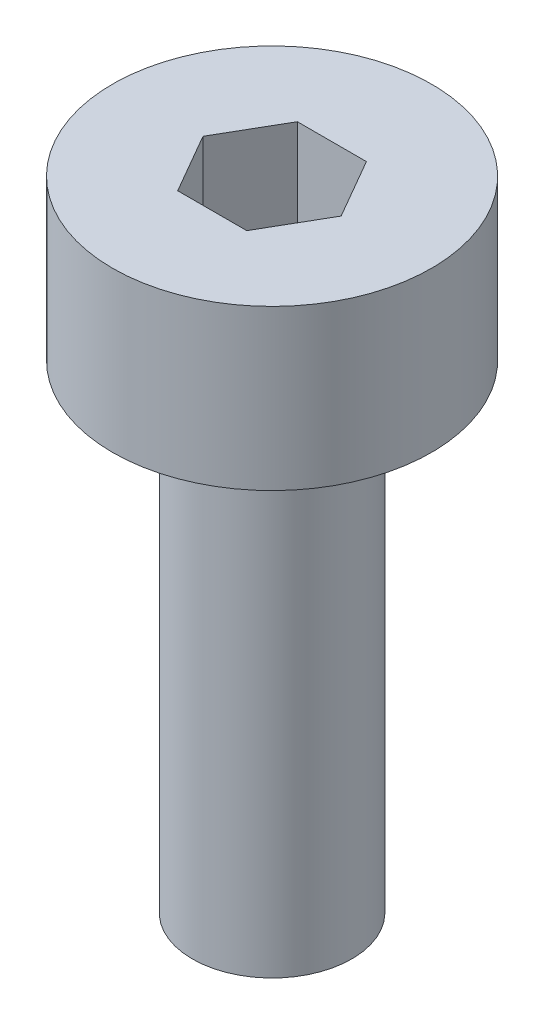
ISO-10303-21;
HEADER;
FILE_DESCRIPTION(('STEP AP214'),'2;1');
FILE_NAME('part.step','',(''),(''),'','','');
FILE_SCHEMA(('AUTOMOTIVE_DESIGN { 1 0 10303 214 1 1 1 1 }'));
ENDSEC;
DATA;
#1=APPLICATION_CONTEXT('core data for automotive mechanical design processes');
#2=APPLICATION_PROTOCOL_DEFINITION('international standard','automotive_design',2000,#1);
#3=PRODUCT_CONTEXT('',#1,'mechanical');
#4=PRODUCT('Part','Part','',(#3));
#5=PRODUCT_RELATED_PRODUCT_CATEGORY('part','',(#4));
#6=PRODUCT_DEFINITION_FORMATION('','',#4);
#7=PRODUCT_DEFINITION_CONTEXT('part definition',#1,'design');
#8=PRODUCT_DEFINITION('design','',#6,#7);
#9=PRODUCT_DEFINITION_SHAPE('','',#8);
#10=(LENGTH_UNIT() NAMED_UNIT(*) SI_UNIT(.MILLI.,.METRE.));
#11=(NAMED_UNIT(*) PLANE_ANGLE_UNIT() SI_UNIT($,.RADIAN.));
#12=(NAMED_UNIT(*) SI_UNIT($,.STERADIAN.) SOLID_ANGLE_UNIT());
#13=UNCERTAINTY_MEASURE_WITH_UNIT(LENGTH_MEASURE(1.E-05),#10,'distance_accuracy_value','');
#14=(GEOMETRIC_REPRESENTATION_CONTEXT(3) GLOBAL_UNCERTAINTY_ASSIGNED_CONTEXT((#13)) GLOBAL_UNIT_ASSIGNED_CONTEXT((#10,
#11,#12)) REPRESENTATION_CONTEXT('',''));
#15=CARTESIAN_POINT('',(0.,0.,0.));
#16=DIRECTION('',(0.,0.,1.));
#17=DIRECTION('',(1.,0.,0.));
#18=AXIS2_PLACEMENT_3D('',#15,#16,#17);
#19=CARTESIAN_POINT('',(0.,12.,0.));
#20=DIRECTION('',(0.,-1.,0.));
#21=DIRECTION('',(0.,0.,-1.));
#22=AXIS2_PLACEMENT_3D('',#19,#20,#21);
#23=CYLINDRICAL_SURFACE('',#22,2.);
#24=CARTESIAN_POINT('',(0.,12.,0.));
#25=DIRECTION('',(0.,1.,0.));
#26=DIRECTION('',(0.,0.,1.));
#27=AXIS2_PLACEMENT_3D('',#24,#25,#26);
#28=CIRCLE('',#27,2.);
#29=CARTESIAN_POINT('',(0.,12.,2.));
#30=VERTEX_POINT('',#29);
#31=EDGE_CURVE('E11',#30,#30,#28,.T.);
#32=ORIENTED_EDGE('',*,*,#31,.F.);
#33=EDGE_LOOP('',(#32));
#34=FACE_BOUND('',#33,.T.);
#35=CARTESIAN_POINT('',(0.,0.,0.));
#36=DIRECTION('',(0.,1.,0.));
#37=DIRECTION('',(0.,0.,1.));
#38=AXIS2_PLACEMENT_3D('',#35,#36,#37);
#39=CIRCLE('',#38,2.);
#40=CARTESIAN_POINT('',(0.,0.,2.));
#41=VERTEX_POINT('',#40);
#42=EDGE_CURVE('E35',#41,#41,#39,.T.);
#43=ORIENTED_EDGE('',*,*,#42,.T.);
#44=EDGE_LOOP('',(#43));
#45=FACE_BOUND('',#44,.T.);
#46=ADVANCED_FACE('F32',(#34,#45),#23,.T.);
#47=CARTESIAN_POINT('',(0.,0.,0.));
#48=DIRECTION('',(0.,1.,0.));
#49=DIRECTION('',(0.,0.,1.));
#50=AXIS2_PLACEMENT_3D('',#47,#48,#49);
#51=PLANE('',#50);
#52=ORIENTED_EDGE('',*,*,#42,.F.);
#53=EDGE_LOOP('',(#52));
#54=FACE_BOUND('',#53,.T.);
#55=ADVANCED_FACE('F163',(#54),#51,.F.);
#56=CARTESIAN_POINT('',(0.,16.,0.));
#57=DIRECTION('',(0.,-1.,0.));
#58=DIRECTION('',(0.,0.,-1.));
#59=AXIS2_PLACEMENT_3D('',#56,#57,#58);
#60=CYLINDRICAL_SURFACE('',#59,4.);
#61=CARTESIAN_POINT('',(0.,16.,0.));
#62=DIRECTION('',(0.,1.,0.));
#63=DIRECTION('',(0.,0.,1.));
#64=AXIS2_PLACEMENT_3D('',#61,#62,#63);
#65=CIRCLE('',#64,4.);
#66=CARTESIAN_POINT('',(0.,16.,4.));
#67=VERTEX_POINT('',#66);
#68=EDGE_CURVE('E139',#67,#67,#65,.T.);
#69=ORIENTED_EDGE('',*,*,#68,.F.);
#70=EDGE_LOOP('',(#69));
#71=FACE_BOUND('',#70,.T.);
#72=CARTESIAN_POINT('',(0.,12.,0.));
#73=DIRECTION('',(0.,1.,0.));
#74=DIRECTION('',(0.,0.,1.));
#75=AXIS2_PLACEMENT_3D('',#72,#73,#74);
#76=CIRCLE('',#75,4.);
#77=CARTESIAN_POINT('',(0.,12.,4.));
#78=VERTEX_POINT('',#77);
#79=EDGE_CURVE('E133',#78,#78,#76,.T.);
#80=ORIENTED_EDGE('',*,*,#79,.T.);
#81=EDGE_LOOP('',(#80));
#82=FACE_BOUND('',#81,.T.);
#83=ADVANCED_FACE('F145',(#71,#82),#60,.T.);
#84=CARTESIAN_POINT('',(0.,16.,0.));
#85=DIRECTION('',(0.,1.,0.));
#86=DIRECTION('',(0.,0.,1.));
#87=AXIS2_PLACEMENT_3D('',#84,#85,#86);
#88=PLANE('',#87);
#89=DIRECTION('',(0.5,0.,-0.866025403784439));
#90=VECTOR('',#89,1.);
#91=CARTESIAN_POINT('',(0.866025403784438,16.,1.5));
#92=LINE('',#91,#90);
#93=CARTESIAN_POINT('',(0.866025403784438,16.,1.5));
#94=VERTEX_POINT('',#93);
#95=CARTESIAN_POINT('',(1.73205080756888,16.,0.));
#96=VERTEX_POINT('',#95);
#97=EDGE_CURVE('E46',#94,#96,#92,.T.);
#98=ORIENTED_EDGE('',*,*,#97,.F.);
#99=DIRECTION('',(1.,0.,0.));
#100=VECTOR('',#99,1.);
#101=CARTESIAN_POINT('',(-0.866025403784439,16.,1.5));
#102=LINE('',#101,#100);
#103=CARTESIAN_POINT('',(-0.866025403784439,16.,1.5));
#104=VERTEX_POINT('',#103);
#105=EDGE_CURVE('E129',#104,#94,#102,.T.);
#106=ORIENTED_EDGE('',*,*,#105,.F.);
#107=DIRECTION('',(0.5,0.,0.866025403784439));
#108=VECTOR('',#107,1.);
#109=CARTESIAN_POINT('',(-1.73205080756888,16.,0.));
#110=LINE('',#109,#108);
#111=CARTESIAN_POINT('',(-1.73205080756888,16.,0.));
#112=VERTEX_POINT('',#111);
#113=EDGE_CURVE('E127',#112,#104,#110,.T.);
#114=ORIENTED_EDGE('',*,*,#113,.F.);
#115=DIRECTION('',(-0.5,0.,0.866025403784439));
#116=VECTOR('',#115,1.);
#117=CARTESIAN_POINT('',(-0.866025403784438,16.,-1.5));
#118=LINE('',#117,#116);
#119=CARTESIAN_POINT('',(-0.866025403784438,16.,-1.5));
#120=VERTEX_POINT('',#119);
#121=EDGE_CURVE('E94',#120,#112,#118,.T.);
#122=ORIENTED_EDGE('',*,*,#121,.F.);
#123=DIRECTION('',(-1.,0.,0.));
#124=VECTOR('',#123,1.);
#125=CARTESIAN_POINT('',(0.866025403784437,16.,-1.5));
#126=LINE('',#125,#124);
#127=CARTESIAN_POINT('',(0.866025403784437,16.,-1.5));
#128=VERTEX_POINT('',#127);
#129=EDGE_CURVE('E123',#128,#120,#126,.T.);
#130=ORIENTED_EDGE('',*,*,#129,.F.);
#131=DIRECTION('',(-0.5,0.,-0.866025403784439));
#132=VECTOR('',#131,1.);
#133=CARTESIAN_POINT('',(1.73205080756888,16.,0.));
#134=LINE('',#133,#132);
#135=EDGE_CURVE('E120',#96,#128,#134,.T.);
#136=ORIENTED_EDGE('',*,*,#135,.F.);
#137=EDGE_LOOP('',(#98,#106,#114,#122,#130,#136));
#138=FACE_BOUND('',#137,.T.);
#139=ORIENTED_EDGE('',*,*,#68,.T.);
#140=EDGE_LOOP('',(#139));
#141=FACE_BOUND('',#140,.T.);
#142=ADVANCED_FACE('F150',(#138,#141),#88,.T.);
#143=CARTESIAN_POINT('',(0.,12.,0.));
#144=DIRECTION('',(0.,1.,0.));
#145=DIRECTION('',(0.,0.,1.));
#146=AXIS2_PLACEMENT_3D('',#143,#144,#145);
#147=PLANE('',#146);
#148=ORIENTED_EDGE('',*,*,#31,.T.);
#149=EDGE_LOOP('',(#148));
#150=FACE_BOUND('',#149,.T.);
#151=ORIENTED_EDGE('',*,*,#79,.F.);
#152=EDGE_LOOP('',(#151));
#153=FACE_BOUND('',#152,.T.);
#154=ADVANCED_FACE('F147',(#150,#153),#147,.F.);
#155=CARTESIAN_POINT('',(0.866025403784438,13.5,1.5));
#156=DIRECTION('',(0.866025403784439,0.,0.5));
#157=DIRECTION('',(0.5,0.,-0.866025403784439));
#158=AXIS2_PLACEMENT_3D('',#155,#156,#157);
#159=PLANE('',#158);
#160=ORIENTED_EDGE('',*,*,#97,.T.);
#161=DIRECTION('',(0.,1.,0.));
#162=VECTOR('',#161,1.);
#163=CARTESIAN_POINT('',(1.73205080756888,13.5,0.));
#164=LINE('',#163,#162);
#165=CARTESIAN_POINT('',(1.73205080756888,13.5,0.));
#166=VERTEX_POINT('',#165);
#167=EDGE_CURVE('E76',#166,#96,#164,.T.);
#168=ORIENTED_EDGE('',*,*,#167,.F.);
#169=DIRECTION('',(0.5,0.,-0.866025403784439));
#170=VECTOR('',#169,1.);
#171=CARTESIAN_POINT('',(0.866025403784438,13.5,1.5));
#172=LINE('',#171,#170);
#173=CARTESIAN_POINT('',(0.866025403784438,13.5,1.5));
#174=VERTEX_POINT('',#173);
#175=EDGE_CURVE('E131',#174,#166,#172,.T.);
#176=ORIENTED_EDGE('',*,*,#175,.F.);
#177=DIRECTION('',(0.,1.,0.));
#178=VECTOR('',#177,1.);
#179=CARTESIAN_POINT('',(0.866025403784438,13.5,1.5));
#180=LINE('',#179,#178);
#181=EDGE_CURVE('E54',#174,#94,#180,.T.);
#182=ORIENTED_EDGE('',*,*,#181,.T.);
#183=EDGE_LOOP('',(#160,#168,#176,#182));
#184=FACE_BOUND('',#183,.T.);
#185=ADVANCED_FACE('F149',(#184),#159,.F.);
#186=CARTESIAN_POINT('',(-0.866025403784439,13.5,1.5));
#187=DIRECTION('',(0.,0.,1.));
#188=DIRECTION('',(1.,0.,0.));
#189=AXIS2_PLACEMENT_3D('',#186,#187,#188);
#190=PLANE('',#189);
#191=ORIENTED_EDGE('',*,*,#105,.T.);
#192=ORIENTED_EDGE('',*,*,#181,.F.);
#193=DIRECTION('',(1.,0.,0.));
#194=VECTOR('',#193,1.);
#195=CARTESIAN_POINT('',(-0.866025403784439,13.5,1.5));
#196=LINE('',#195,#194);
#197=CARTESIAN_POINT('',(-0.866025403784439,13.5,1.5));
#198=VERTEX_POINT('',#197);
#199=EDGE_CURVE('E106',#198,#174,#196,.T.);
#200=ORIENTED_EDGE('',*,*,#199,.F.);
#201=DIRECTION('',(0.,1.,0.));
#202=VECTOR('',#201,1.);
#203=CARTESIAN_POINT('',(-0.866025403784439,13.5,1.5));
#204=LINE('',#203,#202);
#205=EDGE_CURVE('E98',#198,#104,#204,.T.);
#206=ORIENTED_EDGE('',*,*,#205,.T.);
#207=EDGE_LOOP('',(#191,#192,#200,#206));
#208=FACE_BOUND('',#207,.T.);
#209=ADVANCED_FACE('F157',(#208),#190,.F.);
#210=CARTESIAN_POINT('',(-1.73205080756888,13.5,0.));
#211=DIRECTION('',(-0.866025403784439,0.,0.5));
#212=DIRECTION('',(0.5,0.,0.866025403784439));
#213=AXIS2_PLACEMENT_3D('',#210,#211,#212);
#214=PLANE('',#213);
#215=ORIENTED_EDGE('',*,*,#113,.T.);
#216=ORIENTED_EDGE('',*,*,#205,.F.);
#217=DIRECTION('',(0.5,0.,0.866025403784439));
#218=VECTOR('',#217,1.);
#219=CARTESIAN_POINT('',(-1.73205080756888,13.5,0.));
#220=LINE('',#219,#218);
#221=CARTESIAN_POINT('',(-1.73205080756888,13.5,0.));
#222=VERTEX_POINT('',#221);
#223=EDGE_CURVE('E102',#222,#198,#220,.T.);
#224=ORIENTED_EDGE('',*,*,#223,.F.);
#225=DIRECTION('',(0.,1.,0.));
#226=VECTOR('',#225,1.);
#227=CARTESIAN_POINT('',(-1.73205080756888,13.5,0.));
#228=LINE('',#227,#226);
#229=EDGE_CURVE('E87',#222,#112,#228,.T.);
#230=ORIENTED_EDGE('',*,*,#229,.T.);
#231=EDGE_LOOP('',(#215,#216,#224,#230));
#232=FACE_BOUND('',#231,.T.);
#233=ADVANCED_FACE('F103',(#232),#214,.F.);
#234=CARTESIAN_POINT('',(-0.866025403784438,13.5,-1.5));
#235=DIRECTION('',(-0.866025403784438,0.,-0.5));
#236=DIRECTION('',(-0.5,0.,0.866025403784438));
#237=AXIS2_PLACEMENT_3D('',#234,#235,#236);
#238=PLANE('',#237);
#239=ORIENTED_EDGE('',*,*,#121,.T.);
#240=ORIENTED_EDGE('',*,*,#229,.F.);
#241=DIRECTION('',(-0.5,0.,0.866025403784439));
#242=VECTOR('',#241,1.);
#243=CARTESIAN_POINT('',(-0.866025403784438,13.5,-1.5));
#244=LINE('',#243,#242);
#245=CARTESIAN_POINT('',(-0.866025403784438,13.5,-1.5));
#246=VERTEX_POINT('',#245);
#247=EDGE_CURVE('E91',#246,#222,#244,.T.);
#248=ORIENTED_EDGE('',*,*,#247,.F.);
#249=DIRECTION('',(0.,1.,0.));
#250=VECTOR('',#249,1.);
#251=CARTESIAN_POINT('',(-0.866025403784438,13.5,-1.5));
#252=LINE('',#251,#250);
#253=EDGE_CURVE('E99',#246,#120,#252,.T.);
#254=ORIENTED_EDGE('',*,*,#253,.T.);
#255=EDGE_LOOP('',(#239,#240,#248,#254));
#256=FACE_BOUND('',#255,.T.);
#257=ADVANCED_FACE('F89',(#256),#238,.F.);
#258=CARTESIAN_POINT('',(0.866025403784437,13.5,-1.5));
#259=DIRECTION('',(0.,0.,-1.));
#260=DIRECTION('',(-1.,0.,0.));
#261=AXIS2_PLACEMENT_3D('',#258,#259,#260);
#262=PLANE('',#261);
#263=ORIENTED_EDGE('',*,*,#129,.T.);
#264=ORIENTED_EDGE('',*,*,#253,.F.);
#265=DIRECTION('',(-1.,0.,0.));
#266=VECTOR('',#265,1.);
#267=CARTESIAN_POINT('',(0.866025403784437,13.5,-1.5));
#268=LINE('',#267,#266);
#269=CARTESIAN_POINT('',(0.866025403784437,13.5,-1.5));
#270=VERTEX_POINT('',#269);
#271=EDGE_CURVE('E112',#270,#246,#268,.T.);
#272=ORIENTED_EDGE('',*,*,#271,.F.);
#273=DIRECTION('',(0.,1.,0.));
#274=VECTOR('',#273,1.);
#275=CARTESIAN_POINT('',(0.866025403784437,13.5,-1.5));
#276=LINE('',#275,#274);
#277=EDGE_CURVE('E136',#270,#128,#276,.T.);
#278=ORIENTED_EDGE('',*,*,#277,.T.);
#279=EDGE_LOOP('',(#263,#264,#272,#278));
#280=FACE_BOUND('',#279,.T.);
#281=ADVANCED_FACE('F218',(#280),#262,.F.);
#282=CARTESIAN_POINT('',(1.73205080756888,13.5,0.));
#283=DIRECTION('',(0.866025403784439,0.,-0.5));
#284=DIRECTION('',(-0.5,0.,-0.866025403784439));
#285=AXIS2_PLACEMENT_3D('',#282,#283,#284);
#286=PLANE('',#285);
#287=ORIENTED_EDGE('',*,*,#135,.T.);
#288=ORIENTED_EDGE('',*,*,#277,.F.);
#289=DIRECTION('',(-0.5,0.,-0.866025403784439));
#290=VECTOR('',#289,1.);
#291=CARTESIAN_POINT('',(1.73205080756888,13.5,0.));
#292=LINE('',#291,#290);
#293=EDGE_CURVE('E114',#166,#270,#292,.T.);
#294=ORIENTED_EDGE('',*,*,#293,.F.);
#295=ORIENTED_EDGE('',*,*,#167,.T.);
#296=EDGE_LOOP('',(#287,#288,#294,#295));
#297=FACE_BOUND('',#296,.T.);
#298=ADVANCED_FACE('F227',(#297),#286,.F.);
#299=CARTESIAN_POINT('',(0.,13.5,0.));
#300=DIRECTION('',(0.,1.,0.));
#301=DIRECTION('',(0.,0.,1.));
#302=AXIS2_PLACEMENT_3D('',#299,#300,#301);
#303=PLANE('',#302);
#304=ORIENTED_EDGE('',*,*,#175,.T.);
#305=ORIENTED_EDGE('',*,*,#293,.T.);
#306=ORIENTED_EDGE('',*,*,#271,.T.);
#307=ORIENTED_EDGE('',*,*,#247,.T.);
#308=ORIENTED_EDGE('',*,*,#223,.T.);
#309=ORIENTED_EDGE('',*,*,#199,.T.);
#310=EDGE_LOOP('',(#304,#305,#306,#307,#308,#309));
#311=FACE_BOUND('',#310,.T.);
#312=ADVANCED_FACE('F109',(#311),#303,.T.);
#313=CLOSED_SHELL('',(#46,#55,#83,#142,#154,#185,#209,#233,#257,#281,#298,#312));
#314=MANIFOLD_SOLID_BREP('B2',#313);
#315=ADVANCED_BREP_SHAPE_REPRESENTATION('',(#18,#314),#14);
#316=SHAPE_DEFINITION_REPRESENTATION(#9,#315);
ENDSEC;
END-ISO-10303-21;
